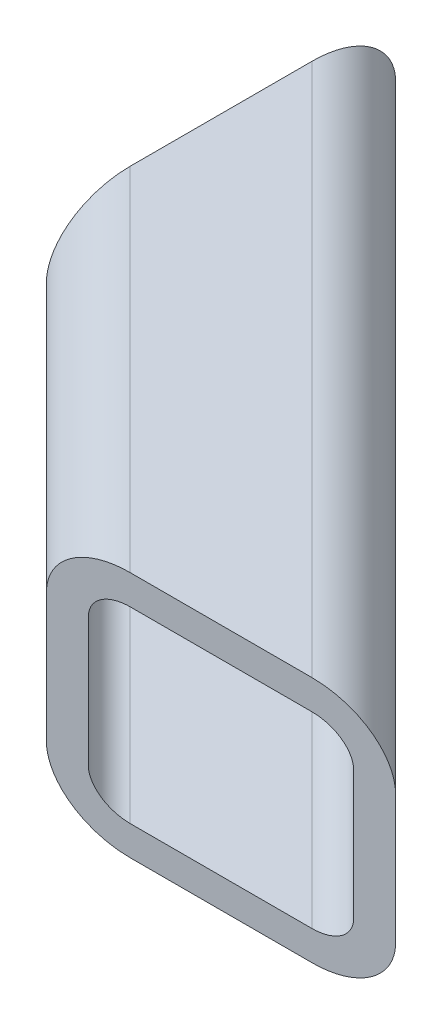
ISO-10303-21;
HEADER;
FILE_DESCRIPTION(('STEP AP214'),'2;1');
FILE_NAME('part.step','',(''),(''),'','','');
FILE_SCHEMA(('AUTOMOTIVE_DESIGN { 1 0 10303 214 1 1 1 1 }'));
ENDSEC;
DATA;
#1=APPLICATION_CONTEXT('core data for automotive mechanical design processes');
#2=APPLICATION_PROTOCOL_DEFINITION('international standard','automotive_design',2000,#1);
#3=PRODUCT_CONTEXT('',#1,'mechanical');
#4=PRODUCT('Part','Part','',(#3));
#5=PRODUCT_RELATED_PRODUCT_CATEGORY('part','',(#4));
#6=PRODUCT_DEFINITION_FORMATION('','',#4);
#7=PRODUCT_DEFINITION_CONTEXT('part definition',#1,'design');
#8=PRODUCT_DEFINITION('design','',#6,#7);
#9=PRODUCT_DEFINITION_SHAPE('','',#8);
#10=(LENGTH_UNIT() NAMED_UNIT(*) SI_UNIT(.MILLI.,.METRE.));
#11=(NAMED_UNIT(*) PLANE_ANGLE_UNIT() SI_UNIT($,.RADIAN.));
#12=(NAMED_UNIT(*) SI_UNIT($,.STERADIAN.) SOLID_ANGLE_UNIT());
#13=UNCERTAINTY_MEASURE_WITH_UNIT(LENGTH_MEASURE(1.E-05),#10,'distance_accuracy_value','');
#14=(GEOMETRIC_REPRESENTATION_CONTEXT(3) GLOBAL_UNCERTAINTY_ASSIGNED_CONTEXT((#13)) GLOBAL_UNIT_ASSIGNED_CONTEXT((#10,
#11,#12)) REPRESENTATION_CONTEXT('',''));
#15=CARTESIAN_POINT('',(0.,0.,0.));
#16=DIRECTION('',(0.,0.,1.));
#17=DIRECTION('',(1.,0.,0.));
#18=AXIS2_PLACEMENT_3D('',#15,#16,#17);
#19=CARTESIAN_POINT('',(72.4802561210746,6.6039999998191,54.5197438789448));
#20=DIRECTION('',(-0.707106781186549,-8.86171155783932E-13,0.707106781186546));
#21=DIRECTION('',(0.707106781186546,0.,0.707106781186549));
#22=AXIS2_PLACEMENT_3D('',#19,#20,#21);
#23=PLANE('',#22);
#24=DIRECTION('',(8.86274531790696E-13,1.,2.13950979888418E-12));
#25=VECTOR('',#24,1.);
#26=CARTESIAN_POINT('',(8.98025612107502,6.60400000001125,-8.98025612105501));
#27=LINE('',#26,#25);
#28=CARTESIAN_POINT('',(8.98025612106332,-6.60399999998874,-8.98025612108327));
#29=VERTEX_POINT('',#28);
#30=CARTESIAN_POINT('',(8.98025612107502,6.60400000001125,-8.98025612105501));
#31=VERTEX_POINT('',#30);
#32=EDGE_CURVE('E194',#29,#31,#27,.T.);
#33=ORIENTED_EDGE('',*,*,#32,.T.);
#34=DIRECTION('',(-0.707106781186546,2.13962300078905E-12,-0.707106781186549));
#35=VECTOR('',#34,1.);
#36=CARTESIAN_POINT('',(72.4802561210746,6.6039999998191,54.5197438789448));
#37=LINE('',#36,#35);
#38=CARTESIAN_POINT('',(72.4802561210746,6.60399999981911,54.5197438789448));
#39=VERTEX_POINT('',#38);
#40=EDGE_CURVE('E224',#39,#31,#37,.T.);
#41=ORIENTED_EDGE('',*,*,#40,.F.);
#42=DIRECTION('',(8.86274531790696E-13,1.,2.13950979888418E-12));
#43=VECTOR('',#42,1.);
#44=CARTESIAN_POINT('',(72.4802561210746,6.6039999998191,54.5197438789448));
#45=LINE('',#44,#43);
#46=CARTESIAN_POINT('',(72.4802561210629,-6.60400000018088,54.5197438789165));
#47=VERTEX_POINT('',#46);
#48=EDGE_CURVE('E243',#47,#39,#45,.T.);
#49=ORIENTED_EDGE('',*,*,#48,.F.);
#50=DIRECTION('',(-0.707106781186546,2.13962300078905E-12,-0.707106781186549));
#51=VECTOR('',#50,1.);
#52=CARTESIAN_POINT('',(72.4802561210629,-6.60400000018088,54.5197438789165));
#53=LINE('',#52,#51);
#54=EDGE_CURVE('E218',#47,#29,#53,.T.);
#55=ORIENTED_EDGE('',*,*,#54,.T.);
#56=EDGE_LOOP('',(#33,#41,#49,#55));
#57=FACE_BOUND('',#56,.T.);
#58=ADVANCED_FACE('F73',(#57),#23,.F.);
#59=CARTESIAN_POINT('',(68.1697331829497,-6.60400000018628,58.8302668170297));
#60=DIRECTION('',(-0.707106781186546,2.13962300078905E-12,-0.707106781186549));
#61=DIRECTION('',(-0.707106781186549,0.,0.707106781186546));
#62=AXIS2_PLACEMENT_3D('',#59,#60,#61);
#63=CYLINDRICAL_SURFACE('',#62,6.096);
#64=DIRECTION('',(-0.707106781186546,2.13962300078905E-12,-0.707106781186549));
#65=VECTOR('',#64,1.);
#66=CARTESIAN_POINT('',(68.1697331829443,-12.7000000001863,58.8302668170167));
#67=LINE('',#66,#65);
#68=CARTESIAN_POINT('',(63.8592102448311,-12.7000000001732,54.5197438789035));
#69=VERTEX_POINT('',#68);
#70=CARTESIAN_POINT('',(8.98025612105791,-12.7000000000072,-0.359210244869913));
#71=VERTEX_POINT('',#70);
#72=EDGE_CURVE('E207',#69,#71,#67,.T.);
#73=ORIENTED_EDGE('',*,*,#72,.T.);
#74=CARTESIAN_POINT('',(8.98025612106333,-6.60400000000718,-0.359210244856849));
#75=DIRECTION('',(1.,-8.8615833102998E-13,0.));
#76=DIRECTION('',(0.,2.13972553505132E-12,-1.));
#77=AXIS2_PLACEMENT_3D('',#74,#75,#76);
#78=ELLIPSE('',#77,8.6210458762264,6.096);
#79=EDGE_CURVE('E188',#71,#29,#78,.T.);
#80=ORIENTED_EDGE('',*,*,#79,.T.);
#81=ORIENTED_EDGE('',*,*,#54,.F.);
#82=CARTESIAN_POINT('',(63.8592102448365,-6.60400000017324,54.5197438789165));
#83=DIRECTION('',(0.,2.13972553505132E-12,-1.));
#84=DIRECTION('',(-1.,8.86158331029979E-13,0.));
#85=AXIS2_PLACEMENT_3D('',#82,#83,#84);
#86=ELLIPSE('',#85,8.62104587622638,6.096);
#87=EDGE_CURVE('E216',#47,#69,#86,.T.);
#88=ORIENTED_EDGE('',*,*,#87,.T.);
#89=EDGE_LOOP('',(#73,#80,#81,#88));
#90=FACE_BOUND('',#89,.T.);
#91=ADVANCED_FACE('F215',(#90),#63,.T.);
#92=CARTESIAN_POINT('',(58.8302668170324,-12.700000000198,68.1697331829286));
#93=DIRECTION('',(8.86344072207046E-13,1.,2.13953979387425E-12));
#94=DIRECTION('',(0.,-2.13953979387425E-12,1.));
#95=AXIS2_PLACEMENT_3D('',#92,#93,#94);
#96=PLANE('',#95);
#97=DIRECTION('',(-0.707106781186546,2.13962300078905E-12,-0.707106781186549));
#98=VECTOR('',#97,1.);
#99=CARTESIAN_POINT('',(58.8302668170324,-12.700000000198,68.1697331829286));
#100=LINE('',#99,#98);
#101=CARTESIAN_POINT('',(45.1802775130073,-12.7000000001567,54.5197438789035));
#102=VERTEX_POINT('',#101);
#103=CARTESIAN_POINT('',(8.98025612105791,-12.7000000000472,18.319722486954));
#104=VERTEX_POINT('',#103);
#105=EDGE_CURVE('E209',#102,#104,#100,.T.);
#106=ORIENTED_EDGE('',*,*,#105,.T.);
#107=DIRECTION('',(0.,-2.13953979387425E-12,1.));
#108=VECTOR('',#107,1.);
#109=CARTESIAN_POINT('',(8.98025612105792,-12.6999999999887,-8.98025612109632));
#110=LINE('',#109,#108);
#111=EDGE_CURVE('E191',#71,#104,#110,.T.);
#112=ORIENTED_EDGE('',*,*,#111,.F.);
#113=ORIENTED_EDGE('',*,*,#72,.F.);
#114=DIRECTION('',(1.,-8.86344072207045E-13,0.));
#115=VECTOR('',#114,1.);
#116=CARTESIAN_POINT('',(72.4802561210575,-12.7000000001809,54.5197438789035));
#117=LINE('',#116,#115);
#118=EDGE_CURVE('E361',#102,#69,#117,.T.);
#119=ORIENTED_EDGE('',*,*,#118,.F.);
#120=EDGE_LOOP('',(#106,#112,#113,#119));
#121=FACE_BOUND('',#120,.T.);
#122=ADVANCED_FACE('F205',(#121),#96,.F.);
#123=CARTESIAN_POINT('',(58.8302668170378,-6.60400000019799,68.1697331829416));
#124=DIRECTION('',(-0.707106781186546,2.13962300078905E-12,-0.707106781186549));
#125=DIRECTION('',(-0.707106781186549,0.,0.707106781186546));
#126=AXIS2_PLACEMENT_3D('',#123,#124,#125);
#127=CYLINDRICAL_SURFACE('',#126,6.096);
#128=DIRECTION('',(-0.707106781186546,2.13962300078905E-12,-0.707106781186549));
#129=VECTOR('',#128,1.);
#130=CARTESIAN_POINT('',(54.5197438789246,-6.60400000020339,72.4802561210548));
#131=LINE('',#130,#129);
#132=CARTESIAN_POINT('',(36.5592316367863,-6.60400000014905,54.5197438789165));
#133=VERTEX_POINT('',#132);
#134=CARTESIAN_POINT('',(8.98025612106331,-6.60400000003843,26.9407683631934));
#135=VERTEX_POINT('',#134);
#136=EDGE_CURVE('E222',#133,#135,#131,.T.);
#137=ORIENTED_EDGE('',*,*,#136,.T.);
#138=CARTESIAN_POINT('',(8.98025612106332,-6.60400000004715,18.319722486967));
#139=DIRECTION('',(1.,-8.8615833102998E-13,0.));
#140=DIRECTION('',(0.,2.13972553505132E-12,-1.));
#141=AXIS2_PLACEMENT_3D('',#138,#139,#140);
#142=ELLIPSE('',#141,8.6210458762264,6.096);
#143=EDGE_CURVE('E200',#135,#104,#142,.T.);
#144=ORIENTED_EDGE('',*,*,#143,.T.);
#145=ORIENTED_EDGE('',*,*,#105,.F.);
#146=CARTESIAN_POINT('',(45.1802775130127,-6.60400000015669,54.5197438789165));
#147=DIRECTION('',(0.,2.13972553505132E-12,-1.));
#148=DIRECTION('',(-1.,8.86158331029979E-13,0.));
#149=AXIS2_PLACEMENT_3D('',#146,#147,#148);
#150=ELLIPSE('',#149,8.62104587622638,6.096);
#151=EDGE_CURVE('E293',#102,#133,#150,.T.);
#152=ORIENTED_EDGE('',*,*,#151,.T.);
#153=EDGE_LOOP('',(#137,#144,#145,#152));
#154=FACE_BOUND('',#153,.T.);
#155=ADVANCED_FACE('F384',(#154),#127,.T.);
#156=CARTESIAN_POINT('',(54.5197438789246,-6.60400000020339,72.4802561210548));
#157=DIRECTION('',(0.707106781186549,8.86356896960999E-13,-0.707106781186546));
#158=DIRECTION('',(-0.707106781186546,0.,-0.707106781186549));
#159=AXIS2_PLACEMENT_3D('',#156,#157,#158);
#160=PLANE('',#159);
#161=DIRECTION('',(-0.707106781186546,2.13962300078905E-12,-0.707106781186549));
#162=VECTOR('',#161,1.);
#163=CARTESIAN_POINT('',(54.5197438789363,6.60399999979659,72.4802561210831));
#164=LINE('',#163,#162);
#165=CARTESIAN_POINT('',(36.559231636798,6.60399999998873,54.5197438789448));
#166=VERTEX_POINT('',#165);
#167=CARTESIAN_POINT('',(8.98025612107502,6.60399999998874,26.9407683632216));
#168=VERTEX_POINT('',#167);
#169=EDGE_CURVE('E231',#166,#168,#164,.T.);
#170=ORIENTED_EDGE('',*,*,#169,.T.);
#171=DIRECTION('',(8.86158331029979E-13,1.,2.13972553505132E-12));
#172=VECTOR('',#171,1.);
#173=CARTESIAN_POINT('',(8.98025612102232,-52.8609262842119,26.9407683630944));
#174=LINE('',#173,#172);
#175=EDGE_CURVE('E212',#135,#168,#174,.T.);
#176=ORIENTED_EDGE('',*,*,#175,.F.);
#177=ORIENTED_EDGE('',*,*,#136,.F.);
#178=DIRECTION('',(8.86158331029979E-13,1.,2.13972553505132E-12));
#179=VECTOR('',#178,1.);
#180=CARTESIAN_POINT('',(36.5592316367453,-52.8609262842954,54.5197438788175));
#181=LINE('',#180,#179);
#182=EDGE_CURVE('E357',#133,#166,#181,.T.);
#183=ORIENTED_EDGE('',*,*,#182,.T.);
#184=EDGE_LOOP('',(#170,#176,#177,#183));
#185=FACE_BOUND('',#184,.T.);
#186=ADVANCED_FACE('F381',(#185),#160,.F.);
#187=CARTESIAN_POINT('',(58.8302668170495,6.60399999980199,68.1697331829699));
#188=DIRECTION('',(-0.707106781186546,2.13962300078905E-12,-0.707106781186549));
#189=DIRECTION('',(-0.707106781186549,0.,0.707106781186546));
#190=AXIS2_PLACEMENT_3D('',#187,#188,#189);
#191=CYLINDRICAL_SURFACE('',#190,6.096);
#192=DIRECTION('',(-0.707106781186546,2.13962300078905E-12,-0.707106781186549));
#193=VECTOR('',#192,1.);
#194=CARTESIAN_POINT('',(58.8302668170549,12.699999999802,68.1697331829829));
#195=LINE('',#194,#193);
#196=CARTESIAN_POINT('',(45.1802775130298,12.6999999998433,54.5197438789578));
#197=VERTEX_POINT('',#196);
#198=CARTESIAN_POINT('',(8.98025612108042,12.6999999999528,18.3197224870083));
#199=VERTEX_POINT('',#198);
#200=EDGE_CURVE('E83',#197,#199,#195,.T.);
#201=ORIENTED_EDGE('',*,*,#200,.T.);
#202=CARTESIAN_POINT('',(8.98025612107502,6.60399999995284,18.3197224869953));
#203=DIRECTION('',(1.,-8.8615833102998E-13,0.));
#204=DIRECTION('',(0.,2.13972553505132E-12,-1.));
#205=AXIS2_PLACEMENT_3D('',#202,#203,#204);
#206=ELLIPSE('',#205,8.6210458762264,6.096);
#207=EDGE_CURVE('E325',#199,#168,#206,.T.);
#208=ORIENTED_EDGE('',*,*,#207,.T.);
#209=ORIENTED_EDGE('',*,*,#169,.F.);
#210=CARTESIAN_POINT('',(45.1802775130244,6.6039999998433,54.5197438789448));
#211=DIRECTION('',(0.,2.13972553505132E-12,-1.));
#212=DIRECTION('',(-1.,8.86158331029979E-13,0.));
#213=AXIS2_PLACEMENT_3D('',#210,#211,#212);
#214=ELLIPSE('',#213,8.62104587622638,6.096);
#215=EDGE_CURVE('E289',#166,#197,#214,.T.);
#216=ORIENTED_EDGE('',*,*,#215,.T.);
#217=EDGE_LOOP('',(#201,#208,#209,#216));
#218=FACE_BOUND('',#217,.T.);
#219=ADVANCED_FACE('F378',(#218),#191,.T.);
#220=CARTESIAN_POINT('',(68.1697331829668,12.6999999998137,58.830266817071));
#221=DIRECTION('',(-8.86158331029979E-13,-1.,-2.13972553505132E-12));
#222=DIRECTION('',(0.,2.13972553505132E-12,-1.));
#223=AXIS2_PLACEMENT_3D('',#220,#221,#222);
#224=PLANE('',#223);
#225=DIRECTION('',(-0.707106781186546,2.13962300078905E-12,-0.707106781186549));
#226=VECTOR('',#225,1.);
#227=CARTESIAN_POINT('',(68.1697331829668,12.6999999998137,58.830266817071));
#228=LINE('',#227,#226);
#229=CARTESIAN_POINT('',(63.8592102448536,12.6999999998268,54.5197438789578));
#230=VERTEX_POINT('',#229);
#231=CARTESIAN_POINT('',(8.98025612108042,12.6999999999928,-0.359210244815535));
#232=VERTEX_POINT('',#231);
#233=EDGE_CURVE('E12',#230,#232,#228,.T.);
#234=ORIENTED_EDGE('',*,*,#233,.T.);
#235=DIRECTION('',(0.,2.13970492639339E-12,-1.));
#236=VECTOR('',#235,1.);
#237=CARTESIAN_POINT('',(8.98025612108043,12.7000000000113,-8.98025612104197));
#238=LINE('',#237,#236);
#239=EDGE_CURVE('E356',#199,#232,#238,.T.);
#240=ORIENTED_EDGE('',*,*,#239,.F.);
#241=ORIENTED_EDGE('',*,*,#200,.F.);
#242=DIRECTION('',(-1.,8.86171155783935E-13,0.));
#243=VECTOR('',#242,1.);
#244=CARTESIAN_POINT('',(72.48025612108,12.6999999998191,54.5197438789578));
#245=LINE('',#244,#243);
#246=EDGE_CURVE('E353',#230,#197,#245,.T.);
#247=ORIENTED_EDGE('',*,*,#246,.F.);
#248=EDGE_LOOP('',(#234,#240,#241,#247));
#249=FACE_BOUND('',#248,.T.);
#250=ADVANCED_FACE('F373',(#249),#224,.F.);
#251=CARTESIAN_POINT('',(68.1697331829614,6.6039999998137,58.830266817058));
#252=DIRECTION('',(-0.707106781186546,2.13962300078905E-12,-0.707106781186549));
#253=DIRECTION('',(-0.707106781186549,0.,0.707106781186546));
#254=AXIS2_PLACEMENT_3D('',#251,#252,#253);
#255=CYLINDRICAL_SURFACE('',#254,6.096);
#256=ORIENTED_EDGE('',*,*,#40,.T.);
#257=CARTESIAN_POINT('',(8.98025612107503,6.6039999999928,-0.359210244828601));
#258=DIRECTION('',(1.,-8.8615833102998E-13,0.));
#259=DIRECTION('',(0.,2.13972553505132E-12,-1.));
#260=AXIS2_PLACEMENT_3D('',#257,#258,#259);
#261=ELLIPSE('',#260,8.6210458762264,6.096);
#262=EDGE_CURVE('E322',#31,#232,#261,.T.);
#263=ORIENTED_EDGE('',*,*,#262,.T.);
#264=ORIENTED_EDGE('',*,*,#233,.F.);
#265=CARTESIAN_POINT('',(63.8592102448482,6.60399999982675,54.5197438789448));
#266=DIRECTION('',(0.,2.13972553505132E-12,-1.));
#267=DIRECTION('',(-1.,8.86158331029979E-13,0.));
#268=AXIS2_PLACEMENT_3D('',#265,#266,#267);
#269=ELLIPSE('',#268,8.62104587622638,6.096);
#270=EDGE_CURVE('E284',#230,#39,#269,.T.);
#271=ORIENTED_EDGE('',*,*,#270,.T.);
#272=EDGE_LOOP('',(#256,#263,#264,#271));
#273=FACE_BOUND('',#272,.T.);
#274=ADVANCED_FACE('F371',(#273),#255,.T.);
#275=CARTESIAN_POINT('',(8.98025612102233,-52.8609262841351,-8.98025612118225));
#276=DIRECTION('',(1.,-8.8615833102998E-13,0.));
#277=DIRECTION('',(8.8615833102998E-13,1.,0.));
#278=AXIS2_PLACEMENT_3D('',#275,#276,#277);
#279=PLANE('',#278);
#280=CARTESIAN_POINT('',(8.98025612107502,6.60399999995284,18.3197224869953));
#281=DIRECTION('',(1.,-8.8615833102998E-13,0.));
#282=DIRECTION('',(0.,2.13972553505132E-12,-1.));
#283=AXIS2_PLACEMENT_3D('',#280,#281,#282);
#284=ELLIPSE('',#283,4.3105229381132,3.048);
#285=CARTESIAN_POINT('',(8.98025612107772,9.65199999995284,18.3197224870018));
#286=VERTEX_POINT('',#285);
#287=CARTESIAN_POINT('',(8.98025612106503,6.60399999994361,22.6302454250985));
#288=VERTEX_POINT('',#287);
#289=EDGE_CURVE('E99',#286,#288,#284,.T.);
#290=ORIENTED_EDGE('',*,*,#289,.T.);
#291=DIRECTION('',(-8.86158331029979E-13,-1.,-2.13991895350686E-12));
#292=VECTOR('',#291,1.);
#293=CARTESIAN_POINT('',(8.98025612106331,-6.60400000005636,22.6302454250802));
#294=LINE('',#293,#292);
#295=CARTESIAN_POINT('',(8.98025612106331,-6.60400000020069,22.6302454250802));
#296=VERTEX_POINT('',#295);
#297=EDGE_CURVE('E211',#288,#296,#294,.T.);
#298=ORIENTED_EDGE('',*,*,#297,.T.);
#299=CARTESIAN_POINT('',(8.98025612106332,-6.60400000004715,18.319722486967));
#300=DIRECTION('',(1.,-8.8615833102998E-13,0.));
#301=DIRECTION('',(0.,2.13972553505132E-12,-1.));
#302=AXIS2_PLACEMENT_3D('',#299,#300,#301);
#303=ELLIPSE('',#302,4.3105229381132,3.048);
#304=CARTESIAN_POINT('',(8.98025612106062,-9.65200000004715,18.3197224869605));
#305=VERTEX_POINT('',#304);
#306=EDGE_CURVE('E348',#296,#305,#303,.T.);
#307=ORIENTED_EDGE('',*,*,#306,.T.);
#308=DIRECTION('',(0.,2.13953979387425E-12,-1.));
#309=VECTOR('',#308,1.);
#310=CARTESIAN_POINT('',(8.9802561210606,-9.65200000015381,68.1697331829351));
#311=LINE('',#310,#309);
#312=CARTESIAN_POINT('',(8.98025612106062,-9.65200000000719,-0.359210244863378));
#313=VERTEX_POINT('',#312);
#314=EDGE_CURVE('E345',#305,#313,#311,.T.);
#315=ORIENTED_EDGE('',*,*,#314,.T.);
#316=CARTESIAN_POINT('',(8.98025612106333,-6.60400000000718,-0.359210244856849));
#317=DIRECTION('',(1.,-8.8615833102998E-13,0.));
#318=DIRECTION('',(0.,2.13972553505132E-12,-1.));
#319=AXIS2_PLACEMENT_3D('',#316,#317,#318);
#320=ELLIPSE('',#319,4.3105229381132,3.048);
#321=CARTESIAN_POINT('',(8.98025612106333,-6.60399999999796,-4.66973318297005));
#322=VERTEX_POINT('',#321);
#323=EDGE_CURVE('E342',#313,#322,#320,.T.);
#324=ORIENTED_EDGE('',*,*,#323,.T.);
#325=DIRECTION('',(8.86158331029979E-13,1.,2.13952493696931E-12));
#326=VECTOR('',#325,1.);
#327=CARTESIAN_POINT('',(8.98025612107502,6.60400000000201,-4.66973318294181));
#328=LINE('',#327,#326);
#329=CARTESIAN_POINT('',(8.98025612107502,6.60400000000855,-4.66973318294181));
#330=VERTEX_POINT('',#329);
#331=EDGE_CURVE('E339',#322,#330,#328,.T.);
#332=ORIENTED_EDGE('',*,*,#331,.T.);
#333=CARTESIAN_POINT('',(8.98025612107503,6.6039999999928,-0.359210244828601));
#334=DIRECTION('',(1.,-8.8615833102998E-13,0.));
#335=DIRECTION('',(0.,2.13972553505132E-12,-1.));
#336=AXIS2_PLACEMENT_3D('',#333,#334,#335);
#337=ELLIPSE('',#336,4.3105229381132,3.048);
#338=CARTESIAN_POINT('',(8.98025612107774,9.65199999999281,-0.359210244822078));
#339=VERTEX_POINT('',#338);
#340=EDGE_CURVE('E336',#330,#339,#337,.T.);
#341=ORIENTED_EDGE('',*,*,#340,.T.);
#342=DIRECTION('',(0.,-2.13972553505132E-12,1.));
#343=VECTOR('',#342,1.);
#344=CARTESIAN_POINT('',(8.98025612107771,9.65199999986616,58.8302668170645));
#345=LINE('',#344,#343);
#346=EDGE_CURVE('E333',#339,#286,#345,.T.);
#347=ORIENTED_EDGE('',*,*,#346,.T.);
#348=EDGE_LOOP('',(#290,#298,#307,#315,#324,#332,#341,#347));
#349=FACE_BOUND('',#348,.T.);
#350=ORIENTED_EDGE('',*,*,#32,.F.);
#351=ORIENTED_EDGE('',*,*,#79,.F.);
#352=ORIENTED_EDGE('',*,*,#111,.T.);
#353=ORIENTED_EDGE('',*,*,#143,.F.);
#354=ORIENTED_EDGE('',*,*,#175,.T.);
#355=ORIENTED_EDGE('',*,*,#207,.F.);
#356=ORIENTED_EDGE('',*,*,#239,.T.);
#357=ORIENTED_EDGE('',*,*,#262,.F.);
#358=EDGE_LOOP('',(#350,#351,#352,#353,#354,#355,#356,#357));
#359=FACE_BOUND('',#358,.T.);
#360=ADVANCED_FACE('F190',(#349,#359),#279,.F.);
#361=CARTESIAN_POINT('',(72.4802561210219,-52.8609262843272,54.5197438788175));
#362=DIRECTION('',(0.,2.13972553505132E-12,-1.));
#363=DIRECTION('',(0.,1.,2.13972553505132E-12));
#364=AXIS2_PLACEMENT_3D('',#361,#362,#363);
#365=PLANE('',#364);
#366=CARTESIAN_POINT('',(45.1802775130244,6.6039999998433,54.5197438789448));
#367=DIRECTION('',(0.,2.13972553505132E-12,-1.));
#368=DIRECTION('',(-1.,8.86158331029979E-13,0.));
#369=AXIS2_PLACEMENT_3D('',#366,#367,#368);
#370=ELLIPSE('',#369,4.31052293811319,3.048);
#371=CARTESIAN_POINT('',(40.8697545749112,6.60399999999143,54.5197438789448));
#372=VERTEX_POINT('',#371);
#373=CARTESIAN_POINT('',(45.1802775130271,9.65199999984331,54.5197438789513));
#374=VERTEX_POINT('',#373);
#375=EDGE_CURVE('E299',#372,#374,#370,.T.);
#376=ORIENTED_EDGE('',*,*,#375,.T.);
#377=DIRECTION('',(1.,-8.86158331029979E-13,0.));
#378=VECTOR('',#377,1.);
#379=CARTESIAN_POINT('',(68.1697331829641,9.65199999982293,54.5197438789513));
#380=LINE('',#379,#378);
#381=CARTESIAN_POINT('',(63.8592102448509,9.65199999982675,54.5197438789513));
#382=VERTEX_POINT('',#381);
#383=EDGE_CURVE('E302',#374,#382,#380,.T.);
#384=ORIENTED_EDGE('',*,*,#383,.T.);
#385=CARTESIAN_POINT('',(63.8592102448482,6.60399999982675,54.5197438789448));
#386=DIRECTION('',(0.,2.13972553505132E-12,-1.));
#387=DIRECTION('',(-1.,8.86158331029979E-13,0.));
#388=AXIS2_PLACEMENT_3D('',#385,#386,#387);
#389=ELLIPSE('',#388,4.31052293811319,3.048);
#390=CARTESIAN_POINT('',(68.1697331829614,6.60400000000855,54.5197438789448));
#391=VERTEX_POINT('',#390);
#392=EDGE_CURVE('E305',#382,#391,#389,.T.);
#393=ORIENTED_EDGE('',*,*,#392,.T.);
#394=DIRECTION('',(-8.86358929111985E-13,-1.,-2.13972553505132E-12));
#395=VECTOR('',#394,1.);
#396=CARTESIAN_POINT('',(68.1697331829614,6.60399999982292,54.5197438789448));
#397=LINE('',#396,#395);
#398=CARTESIAN_POINT('',(68.1697331829497,-6.60400000017706,54.5197438789165));
#399=VERTEX_POINT('',#398);
#400=EDGE_CURVE('E308',#391,#399,#397,.T.);
#401=ORIENTED_EDGE('',*,*,#400,.T.);
#402=CARTESIAN_POINT('',(63.8592102448365,-6.60400000017324,54.5197438789165));
#403=DIRECTION('',(0.,2.13972553505132E-12,-1.));
#404=DIRECTION('',(-1.,8.86158331029979E-13,0.));
#405=AXIS2_PLACEMENT_3D('',#402,#403,#404);
#406=ELLIPSE('',#405,4.31052293811319,3.048);
#407=CARTESIAN_POINT('',(63.8592102448338,-9.65200000017325,54.51974387891));
#408=VERTEX_POINT('',#407);
#409=EDGE_CURVE('E311',#399,#408,#406,.T.);
#410=ORIENTED_EDGE('',*,*,#409,.T.);
#411=DIRECTION('',(-1.,8.86344072207045E-13,0.));
#412=VECTOR('',#411,1.);
#413=CARTESIAN_POINT('',(58.8302668170351,-9.65200000016879,54.51974387891));
#414=LINE('',#413,#412);
#415=CARTESIAN_POINT('',(45.18027751301,-9.65200000015669,54.51974387891));
#416=VERTEX_POINT('',#415);
#417=EDGE_CURVE('E314',#408,#416,#414,.T.);
#418=ORIENTED_EDGE('',*,*,#417,.T.);
#419=CARTESIAN_POINT('',(45.1802775130127,-6.60400000015669,54.5197438789165));
#420=DIRECTION('',(0.,2.13972553505132E-12,-1.));
#421=DIRECTION('',(-1.,8.86158331029979E-13,0.));
#422=AXIS2_PLACEMENT_3D('',#419,#420,#421);
#423=ELLIPSE('',#422,4.31052293811319,3.048);
#424=CARTESIAN_POINT('',(40.8697545749095,-6.60400000015287,54.5197438789265));
#425=VERTEX_POINT('',#424);
#426=EDGE_CURVE('E91',#416,#425,#423,.T.);
#427=ORIENTED_EDGE('',*,*,#426,.T.);
#428=DIRECTION('',(8.85964912574438E-13,1.,2.13972553505132E-12));
#429=VECTOR('',#428,1.);
#430=CARTESIAN_POINT('',(40.8697545748995,-6.60400000015287,54.5197438789165));
#431=LINE('',#430,#429);
#432=EDGE_CURVE('E319',#425,#372,#431,.T.);
#433=ORIENTED_EDGE('',*,*,#432,.T.);
#434=EDGE_LOOP('',(#376,#384,#393,#401,#410,#418,#427,#433));
#435=FACE_BOUND('',#434,.T.);
#436=ORIENTED_EDGE('',*,*,#246,.T.);
#437=ORIENTED_EDGE('',*,*,#215,.F.);
#438=ORIENTED_EDGE('',*,*,#182,.F.);
#439=ORIENTED_EDGE('',*,*,#151,.F.);
#440=ORIENTED_EDGE('',*,*,#118,.T.);
#441=ORIENTED_EDGE('',*,*,#87,.F.);
#442=ORIENTED_EDGE('',*,*,#48,.T.);
#443=ORIENTED_EDGE('',*,*,#270,.F.);
#444=EDGE_LOOP('',(#436,#437,#438,#439,#440,#441,#442,#443));
#445=FACE_BOUND('',#444,.T.);
#446=ADVANCED_FACE('F375',(#435,#445),#365,.F.);
#447=CARTESIAN_POINT('',(58.8302668170495,6.60399999980199,68.1697331829699));
#448=DIRECTION('',(-0.707106781186546,2.13962300078905E-12,-0.707106781186549));
#449=DIRECTION('',(-0.707106781186549,0.,0.707106781186546));
#450=AXIS2_PLACEMENT_3D('',#447,#448,#449);
#451=CYLINDRICAL_SURFACE('',#450,3.048);
#452=ORIENTED_EDGE('',*,*,#289,.F.);
#453=DIRECTION('',(-0.707106781186546,2.13962300078905E-12,-0.707106781186549));
#454=VECTOR('',#453,1.);
#455=CARTESIAN_POINT('',(58.8302668170522,9.651999999802,68.1697331829764));
#456=LINE('',#455,#454);
#457=EDGE_CURVE('E77',#374,#286,#456,.T.);
#458=ORIENTED_EDGE('',*,*,#457,.F.);
#459=ORIENTED_EDGE('',*,*,#375,.F.);
#460=DIRECTION('',(-0.707106781186546,2.13962300078905E-12,-0.707106781186549));
#461=VECTOR('',#460,1.);
#462=CARTESIAN_POINT('',(56.6750053479929,6.60399999979929,70.3249946520264));
#463=LINE('',#462,#461);
#464=EDGE_CURVE('E238',#372,#288,#463,.T.);
#465=ORIENTED_EDGE('',*,*,#464,.T.);
#466=EDGE_LOOP('',(#452,#458,#459,#465));
#467=FACE_BOUND('',#466,.T.);
#468=ADVANCED_FACE('F75',(#467),#451,.F.);
#469=CARTESIAN_POINT('',(68.1697331829641,9.65199999981371,58.8302668170645));
#470=DIRECTION('',(-8.86158331029979E-13,-1.,-2.13972553505132E-12));
#471=DIRECTION('',(0.,2.13972553505132E-12,-1.));
#472=AXIS2_PLACEMENT_3D('',#469,#470,#471);
#473=PLANE('',#472);
#474=ORIENTED_EDGE('',*,*,#346,.F.);
#475=DIRECTION('',(-0.707106781186546,2.13962300078905E-12,-0.707106781186549));
#476=VECTOR('',#475,1.);
#477=CARTESIAN_POINT('',(68.1697331829641,9.65199999981371,58.8302668170645));
#478=LINE('',#477,#476);
#479=EDGE_CURVE('E262',#382,#339,#478,.T.);
#480=ORIENTED_EDGE('',*,*,#479,.F.);
#481=ORIENTED_EDGE('',*,*,#383,.F.);
#482=ORIENTED_EDGE('',*,*,#457,.T.);
#483=EDGE_LOOP('',(#474,#480,#481,#482));
#484=FACE_BOUND('',#483,.T.);
#485=ADVANCED_FACE('F436',(#484),#473,.T.);
#486=CARTESIAN_POINT('',(68.1697331829614,6.6039999998137,58.830266817058));
#487=DIRECTION('',(-0.707106781186546,2.13962300078905E-12,-0.707106781186549));
#488=DIRECTION('',(-0.707106781186549,0.,0.707106781186546));
#489=AXIS2_PLACEMENT_3D('',#486,#487,#488);
#490=CYLINDRICAL_SURFACE('',#489,3.048);
#491=ORIENTED_EDGE('',*,*,#340,.F.);
#492=DIRECTION('',(-0.707106781186546,2.13962300078905E-12,-0.707106781186549));
#493=VECTOR('',#492,1.);
#494=CARTESIAN_POINT('',(70.324994652018,6.6039999998164,56.6750053480014));
#495=LINE('',#494,#493);
#496=EDGE_CURVE('E259',#391,#330,#495,.T.);
#497=ORIENTED_EDGE('',*,*,#496,.F.);
#498=ORIENTED_EDGE('',*,*,#392,.F.);
#499=ORIENTED_EDGE('',*,*,#479,.T.);
#500=EDGE_LOOP('',(#491,#497,#498,#499));
#501=FACE_BOUND('',#500,.T.);
#502=ADVANCED_FACE('F433',(#501),#490,.F.);
#503=CARTESIAN_POINT('',(70.324994652018,6.6039999998164,56.6750053480014));
#504=DIRECTION('',(-0.707106781186549,-8.86264026372466E-13,0.707106781186546));
#505=DIRECTION('',(0.707106781186546,0.,0.707106781186549));
#506=AXIS2_PLACEMENT_3D('',#503,#504,#505);
#507=PLANE('',#506);
#508=ORIENTED_EDGE('',*,*,#331,.F.);
#509=DIRECTION('',(-0.707106781186546,2.13962300078905E-12,-0.707106781186549));
#510=VECTOR('',#509,1.);
#511=CARTESIAN_POINT('',(70.3249946520063,-6.60400000018358,56.6750053479731));
#512=LINE('',#511,#510);
#513=EDGE_CURVE('E255',#399,#322,#512,.T.);
#514=ORIENTED_EDGE('',*,*,#513,.F.);
#515=ORIENTED_EDGE('',*,*,#400,.F.);
#516=ORIENTED_EDGE('',*,*,#496,.T.);
#517=EDGE_LOOP('',(#508,#514,#515,#516));
#518=FACE_BOUND('',#517,.T.);
#519=ADVANCED_FACE('F429',(#518),#507,.T.);
#520=CARTESIAN_POINT('',(68.1697331829497,-6.60400000018628,58.8302668170297));
#521=DIRECTION('',(-0.707106781186546,2.13962300078905E-12,-0.707106781186549));
#522=DIRECTION('',(-0.707106781186549,0.,0.707106781186546));
#523=AXIS2_PLACEMENT_3D('',#520,#521,#522);
#524=CYLINDRICAL_SURFACE('',#523,3.048);
#525=ORIENTED_EDGE('',*,*,#323,.F.);
#526=DIRECTION('',(-0.707106781186546,2.13962300078905E-12,-0.707106781186549));
#527=VECTOR('',#526,1.);
#528=CARTESIAN_POINT('',(68.169733182947,-9.65200000018629,58.8302668170232));
#529=LINE('',#528,#527);
#530=EDGE_CURVE('E251',#408,#313,#529,.T.);
#531=ORIENTED_EDGE('',*,*,#530,.F.);
#532=ORIENTED_EDGE('',*,*,#409,.F.);
#533=ORIENTED_EDGE('',*,*,#513,.T.);
#534=EDGE_LOOP('',(#525,#531,#532,#533));
#535=FACE_BOUND('',#534,.T.);
#536=ADVANCED_FACE('F425',(#535),#524,.F.);
#537=CARTESIAN_POINT('',(58.8302668170351,-9.65200000019799,68.1697331829351));
#538=DIRECTION('',(8.86344072207046E-13,1.,2.13953979387425E-12));
#539=DIRECTION('',(0.,-2.13953979387425E-12,1.));
#540=AXIS2_PLACEMENT_3D('',#537,#538,#539);
#541=PLANE('',#540);
#542=ORIENTED_EDGE('',*,*,#314,.F.);
#543=DIRECTION('',(-0.707106781186546,2.13962300078905E-12,-0.707106781186549));
#544=VECTOR('',#543,1.);
#545=CARTESIAN_POINT('',(58.8302668170351,-9.65200000019799,68.1697331829351));
#546=LINE('',#545,#544);
#547=EDGE_CURVE('E247',#416,#305,#546,.T.);
#548=ORIENTED_EDGE('',*,*,#547,.F.);
#549=ORIENTED_EDGE('',*,*,#417,.F.);
#550=ORIENTED_EDGE('',*,*,#530,.T.);
#551=EDGE_LOOP('',(#542,#548,#549,#550));
#552=FACE_BOUND('',#551,.T.);
#553=ADVANCED_FACE('F421',(#552),#541,.T.);
#554=CARTESIAN_POINT('',(58.8302668170378,-6.60400000019799,68.1697331829416));
#555=DIRECTION('',(-0.707106781186546,2.13962300078905E-12,-0.707106781186549));
#556=DIRECTION('',(-0.707106781186549,0.,0.707106781186546));
#557=AXIS2_PLACEMENT_3D('',#554,#555,#556);
#558=CYLINDRICAL_SURFACE('',#557,3.048);
#559=ORIENTED_EDGE('',*,*,#306,.F.);
#560=DIRECTION('',(-0.707106781186546,2.13962300078905E-12,-0.707106781186549));
#561=VECTOR('',#560,1.);
#562=CARTESIAN_POINT('',(56.6750053479811,-6.60400000020069,70.3249946519982));
#563=LINE('',#562,#561);
#564=EDGE_CURVE('E242',#425,#296,#563,.T.);
#565=ORIENTED_EDGE('',*,*,#564,.F.);
#566=ORIENTED_EDGE('',*,*,#426,.F.);
#567=ORIENTED_EDGE('',*,*,#547,.T.);
#568=EDGE_LOOP('',(#559,#565,#566,#567));
#569=FACE_BOUND('',#568,.T.);
#570=ADVANCED_FACE('F417',(#569),#558,.F.);
#571=CARTESIAN_POINT('',(56.6750053479811,-6.60400000020069,70.3249946519982));
#572=DIRECTION('',(0.707106781186549,8.86542638138065E-13,-0.707106781186546));
#573=DIRECTION('',(-0.707106781186546,0.,-0.707106781186549));
#574=AXIS2_PLACEMENT_3D('',#571,#572,#573);
#575=PLANE('',#574);
#576=ORIENTED_EDGE('',*,*,#297,.F.);
#577=ORIENTED_EDGE('',*,*,#464,.F.);
#578=ORIENTED_EDGE('',*,*,#432,.F.);
#579=ORIENTED_EDGE('',*,*,#564,.T.);
#580=EDGE_LOOP('',(#576,#577,#578,#579));
#581=FACE_BOUND('',#580,.T.);
#582=ADVANCED_FACE('F414',(#581),#575,.T.);
#583=CLOSED_SHELL('',(#58,#91,#122,#155,#186,#219,#250,#274,#360,#446,#468,#485,#502,#519,#536,
#553,#570,#582));
#584=MANIFOLD_SOLID_BREP('B2',#583);
#585=ADVANCED_BREP_SHAPE_REPRESENTATION('',(#18,#584),#14);
#586=SHAPE_DEFINITION_REPRESENTATION(#9,#585);
ENDSEC;
END-ISO-10303-21;
